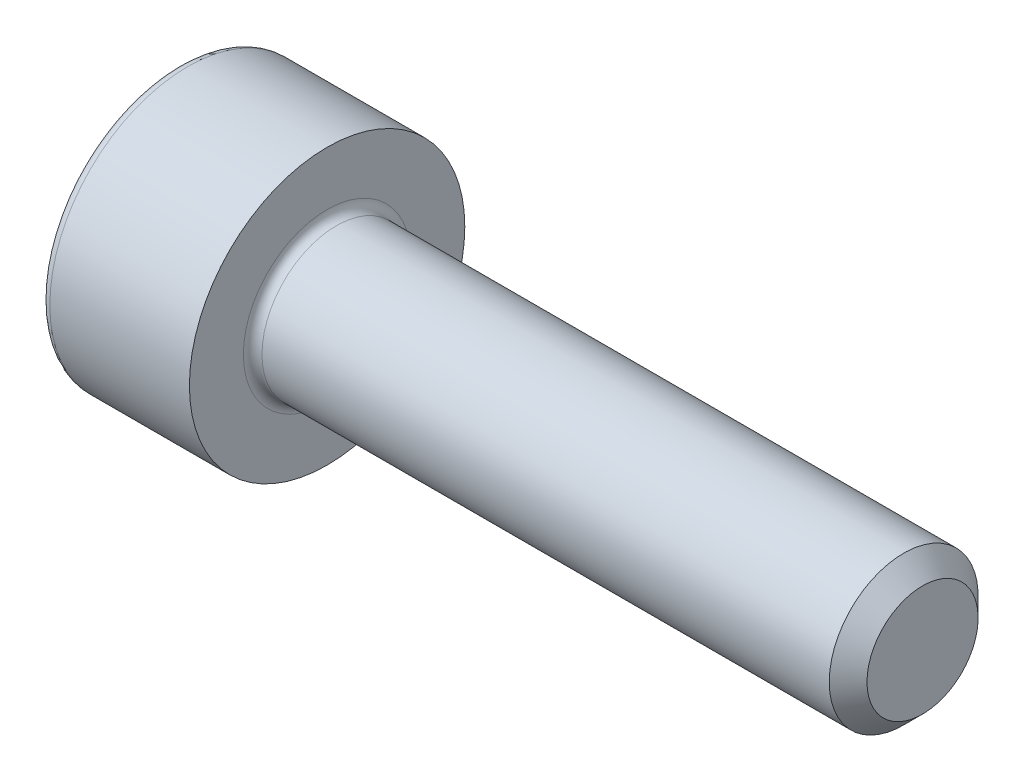
ISO-10303-21;
HEADER;
FILE_DESCRIPTION(('STEP AP214'),'2;1');
FILE_NAME('part.step','',(''),(''),'','','');
FILE_SCHEMA(('AUTOMOTIVE_DESIGN { 1 0 10303 214 1 1 1 1 }'));
ENDSEC;
DATA;
#1=APPLICATION_CONTEXT('core data for automotive mechanical design processes');
#2=APPLICATION_PROTOCOL_DEFINITION('international standard','automotive_design',2000,#1);
#3=PRODUCT_CONTEXT('',#1,'mechanical');
#4=PRODUCT('Part','Part','',(#3));
#5=PRODUCT_RELATED_PRODUCT_CATEGORY('part','',(#4));
#6=PRODUCT_DEFINITION_FORMATION('','',#4);
#7=PRODUCT_DEFINITION_CONTEXT('part definition',#1,'design');
#8=PRODUCT_DEFINITION('design','',#6,#7);
#9=PRODUCT_DEFINITION_SHAPE('','',#8);
#10=(LENGTH_UNIT() NAMED_UNIT(*) SI_UNIT(.MILLI.,.METRE.));
#11=(NAMED_UNIT(*) PLANE_ANGLE_UNIT() SI_UNIT($,.RADIAN.));
#12=(NAMED_UNIT(*) SI_UNIT($,.STERADIAN.) SOLID_ANGLE_UNIT());
#13=UNCERTAINTY_MEASURE_WITH_UNIT(LENGTH_MEASURE(1.E-05),#10,'distance_accuracy_value','');
#14=(GEOMETRIC_REPRESENTATION_CONTEXT(3) GLOBAL_UNCERTAINTY_ASSIGNED_CONTEXT((#13)) GLOBAL_UNIT_ASSIGNED_CONTEXT((#10,
#11,#12)) REPRESENTATION_CONTEXT('',''));
#15=CARTESIAN_POINT('',(0.,0.,0.));
#16=DIRECTION('',(0.,0.,1.));
#17=DIRECTION('',(1.,0.,0.));
#18=AXIS2_PLACEMENT_3D('',#15,#16,#17);
#19=CARTESIAN_POINT('',(8.,0.,0.));
#20=DIRECTION('',(-1.,0.,0.));
#21=DIRECTION('',(0.,0.,1.));
#22=AXIS2_PLACEMENT_3D('',#19,#20,#21);
#23=CONICAL_SURFACE('',#22,0.746499999993504,0.785398163397451);
#24=CARTESIAN_POINT('',(7.7464999999935,0.,0.));
#25=DIRECTION('',(-1.,0.,0.));
#26=DIRECTION('',(0.,0.,1.));
#27=AXIS2_PLACEMENT_3D('',#24,#25,#26);
#28=CIRCLE('',#27,1.);
#29=CARTESIAN_POINT('',(7.7464999999935,0.,1.));
#30=VERTEX_POINT('',#29);
#31=EDGE_CURVE('E11',#30,#30,#28,.T.);
#32=ORIENTED_EDGE('',*,*,#31,.F.);
#33=EDGE_LOOP('',(#32));
#34=FACE_BOUND('',#33,.T.);
#35=CARTESIAN_POINT('',(8.,0.,0.));
#36=DIRECTION('',(-1.,0.,0.));
#37=DIRECTION('',(0.,0.,1.));
#38=AXIS2_PLACEMENT_3D('',#35,#36,#37);
#39=CIRCLE('',#38,0.746499999993504);
#40=CARTESIAN_POINT('',(8.,0.,0.746499999993504));
#41=VERTEX_POINT('',#40);
#42=EDGE_CURVE('E136',#41,#41,#39,.T.);
#43=ORIENTED_EDGE('',*,*,#42,.T.);
#44=EDGE_LOOP('',(#43));
#45=FACE_BOUND('',#44,.T.);
#46=ADVANCED_FACE('F35',(#34,#45),#23,.T.);
#47=CARTESIAN_POINT('',(-2.,0.,0.));
#48=DIRECTION('',(-1.,0.,0.));
#49=DIRECTION('',(0.,0.,1.));
#50=AXIS2_PLACEMENT_3D('',#47,#48,#49);
#51=CYLINDRICAL_SURFACE('',#50,1.);
#52=CARTESIAN_POINT('',(0.125,0.,0.));
#53=DIRECTION('',(-1.,0.,0.));
#54=DIRECTION('',(0.,0.,1.));
#55=AXIS2_PLACEMENT_3D('',#52,#53,#54);
#56=CIRCLE('',#55,1.);
#57=CARTESIAN_POINT('',(0.125,0.,1.));
#58=VERTEX_POINT('',#57);
#59=EDGE_CURVE('E42',#58,#58,#56,.T.);
#60=ORIENTED_EDGE('',*,*,#59,.F.);
#61=EDGE_LOOP('',(#60));
#62=FACE_BOUND('',#61,.T.);
#63=ORIENTED_EDGE('',*,*,#31,.T.);
#64=EDGE_LOOP('',(#63));
#65=FACE_BOUND('',#64,.T.);
#66=ADVANCED_FACE('F160',(#62,#65),#51,.T.);
#67=CARTESIAN_POINT('',(0.125,0.,0.));
#68=DIRECTION('',(-1.,0.,0.));
#69=DIRECTION('',(0.,0.,1.));
#70=AXIS2_PLACEMENT_3D('',#67,#68,#69);
#71=TOROIDAL_SURFACE('',#70,1.125,0.125);
#72=CARTESIAN_POINT('',(0.,0.,0.));
#73=DIRECTION('',(-1.,0.,0.));
#74=DIRECTION('',(0.,0.,1.));
#75=AXIS2_PLACEMENT_3D('',#72,#73,#74);
#76=CIRCLE('',#75,1.125);
#77=CARTESIAN_POINT('',(0.,0.,1.125));
#78=VERTEX_POINT('',#77);
#79=EDGE_CURVE('E153',#78,#78,#76,.T.);
#80=ORIENTED_EDGE('',*,*,#79,.F.);
#81=EDGE_LOOP('',(#80));
#82=FACE_BOUND('',#81,.T.);
#83=ORIENTED_EDGE('',*,*,#59,.T.);
#84=EDGE_LOOP('',(#83));
#85=FACE_BOUND('',#84,.T.);
#86=ADVANCED_FACE('F158',(#82,#85),#71,.F.);
#87=CARTESIAN_POINT('',(0.,1.125,0.));
#88=DIRECTION('',(-1.,0.,0.));
#89=DIRECTION('',(0.,0.,1.));
#90=AXIS2_PLACEMENT_3D('',#87,#88,#89);
#91=PLANE('',#90);
#92=CARTESIAN_POINT('',(0.,0.,0.));
#93=DIRECTION('',(-1.,0.,0.));
#94=DIRECTION('',(0.,0.,1.));
#95=AXIS2_PLACEMENT_3D('',#92,#93,#94);
#96=CIRCLE('',#95,1.85);
#97=CARTESIAN_POINT('',(0.,0.,1.85));
#98=VERTEX_POINT('',#97);
#99=EDGE_CURVE('E150',#98,#98,#96,.T.);
#100=ORIENTED_EDGE('',*,*,#99,.F.);
#101=EDGE_LOOP('',(#100));
#102=FACE_BOUND('',#101,.T.);
#103=ORIENTED_EDGE('',*,*,#79,.T.);
#104=EDGE_LOOP('',(#103));
#105=FACE_BOUND('',#104,.T.);
#106=ADVANCED_FACE('F191',(#102,#105),#91,.F.);
#107=CARTESIAN_POINT('',(-2.,0.,0.));
#108=DIRECTION('',(-1.,0.,0.));
#109=DIRECTION('',(0.,0.,1.));
#110=AXIS2_PLACEMENT_3D('',#107,#108,#109);
#111=CYLINDRICAL_SURFACE('',#110,1.85);
#112=CARTESIAN_POINT('',(-1.875,0.,0.));
#113=DIRECTION('',(-1.,0.,0.));
#114=DIRECTION('',(0.,0.,1.));
#115=AXIS2_PLACEMENT_3D('',#112,#113,#114);
#116=CIRCLE('',#115,1.85);
#117=CARTESIAN_POINT('',(-1.875,0.,1.85));
#118=VERTEX_POINT('',#117);
#119=EDGE_CURVE('E147',#118,#118,#116,.T.);
#120=ORIENTED_EDGE('',*,*,#119,.F.);
#121=EDGE_LOOP('',(#120));
#122=FACE_BOUND('',#121,.T.);
#123=ORIENTED_EDGE('',*,*,#99,.T.);
#124=EDGE_LOOP('',(#123));
#125=FACE_BOUND('',#124,.T.);
#126=ADVANCED_FACE('F187',(#122,#125),#111,.T.);
#127=CARTESIAN_POINT('',(-1.875,0.,0.));
#128=DIRECTION('',(-1.,0.,0.));
#129=DIRECTION('',(0.,0.,1.));
#130=AXIS2_PLACEMENT_3D('',#127,#128,#129);
#131=TOROIDAL_SURFACE('',#130,1.725,0.125);
#132=CARTESIAN_POINT('',(-2.,0.,0.));
#133=DIRECTION('',(-1.,0.,0.));
#134=DIRECTION('',(0.,0.,1.));
#135=AXIS2_PLACEMENT_3D('',#132,#133,#134);
#136=CIRCLE('',#135,1.725);
#137=CARTESIAN_POINT('',(-2.,0.,1.725));
#138=VERTEX_POINT('',#137);
#139=EDGE_CURVE('E144',#138,#138,#136,.T.);
#140=ORIENTED_EDGE('',*,*,#139,.F.);
#141=EDGE_LOOP('',(#140));
#142=FACE_BOUND('',#141,.T.);
#143=ORIENTED_EDGE('',*,*,#119,.T.);
#144=EDGE_LOOP('',(#143));
#145=FACE_BOUND('',#144,.T.);
#146=ADVANCED_FACE('F180',(#142,#145),#131,.T.);
#147=CARTESIAN_POINT('',(-2.,1.725,0.));
#148=DIRECTION('',(1.,0.,0.));
#149=DIRECTION('',(0.,0.,-1.));
#150=AXIS2_PLACEMENT_3D('',#147,#148,#149);
#151=PLANE('',#150);
#152=DIRECTION('',(0.,0.5,-0.866025403784438));
#153=VECTOR('',#152,1.);
#154=CARTESIAN_POINT('',(-2.,0.433012701892219,0.75));
#155=LINE('',#154,#153);
#156=CARTESIAN_POINT('',(-2.,0.433012701892219,0.75));
#157=VERTEX_POINT('',#156);
#158=CARTESIAN_POINT('',(-2.,0.866025403784439,0.));
#159=VERTEX_POINT('',#158);
#160=EDGE_CURVE('E123',#157,#159,#155,.T.);
#161=ORIENTED_EDGE('',*,*,#160,.F.);
#162=DIRECTION('',(0.,1.,0.));
#163=VECTOR('',#162,1.);
#164=CARTESIAN_POINT('',(-2.,-0.43301270189222,0.75));
#165=LINE('',#164,#163);
#166=CARTESIAN_POINT('',(-2.,-0.43301270189222,0.75));
#167=VERTEX_POINT('',#166);
#168=EDGE_CURVE('E49',#167,#157,#165,.T.);
#169=ORIENTED_EDGE('',*,*,#168,.F.);
#170=DIRECTION('',(0.,0.5,0.866025403784439));
#171=VECTOR('',#170,1.);
#172=CARTESIAN_POINT('',(-2.,-0.866025403784439,0.));
#173=LINE('',#172,#171);
#174=CARTESIAN_POINT('',(-2.,-0.866025403784439,0.));
#175=VERTEX_POINT('',#174);
#176=EDGE_CURVE('E132',#175,#167,#173,.T.);
#177=ORIENTED_EDGE('',*,*,#176,.F.);
#178=DIRECTION('',(0.,-0.5,0.866025403784439));
#179=VECTOR('',#178,1.);
#180=CARTESIAN_POINT('',(-2.,-0.433012701892219,-0.75));
#181=LINE('',#180,#179);
#182=CARTESIAN_POINT('',(-2.,-0.433012701892219,-0.75));
#183=VERTEX_POINT('',#182);
#184=EDGE_CURVE('E130',#183,#175,#181,.T.);
#185=ORIENTED_EDGE('',*,*,#184,.F.);
#186=DIRECTION('',(0.,-1.,0.));
#187=VECTOR('',#186,1.);
#188=CARTESIAN_POINT('',(-2.,0.43301270189222,-0.75));
#189=LINE('',#188,#187);
#190=CARTESIAN_POINT('',(-2.,0.43301270189222,-0.75));
#191=VERTEX_POINT('',#190);
#192=EDGE_CURVE('E97',#191,#183,#189,.T.);
#193=ORIENTED_EDGE('',*,*,#192,.F.);
#194=DIRECTION('',(0.,-0.5,-0.866025403784439));
#195=VECTOR('',#194,1.);
#196=CARTESIAN_POINT('',(-2.,0.866025403784439,0.));
#197=LINE('',#196,#195);
#198=EDGE_CURVE('E126',#159,#191,#197,.T.);
#199=ORIENTED_EDGE('',*,*,#198,.F.);
#200=EDGE_LOOP('',(#161,#169,#177,#185,#193,#199));
#201=FACE_BOUND('',#200,.T.);
#202=ORIENTED_EDGE('',*,*,#139,.T.);
#203=EDGE_LOOP('',(#202));
#204=FACE_BOUND('',#203,.T.);
#205=ADVANCED_FACE('F172',(#201,#204),#151,.F.);
#206=CARTESIAN_POINT('',(8.,0.746499999993504,0.));
#207=DIRECTION('',(-1.,0.,0.));
#208=DIRECTION('',(0.,0.,1.));
#209=AXIS2_PLACEMENT_3D('',#206,#207,#208);
#210=PLANE('',#209);
#211=ORIENTED_EDGE('',*,*,#42,.F.);
#212=EDGE_LOOP('',(#211));
#213=FACE_BOUND('',#212,.T.);
#214=ADVANCED_FACE('F169',(#213),#210,.F.);
#215=CARTESIAN_POINT('',(-0.9,-0.43301270189222,0.75));
#216=DIRECTION('',(0.,0.,1.));
#217=DIRECTION('',(1.,0.,0.));
#218=AXIS2_PLACEMENT_3D('',#215,#216,#217);
#219=PLANE('',#218);
#220=ORIENTED_EDGE('',*,*,#168,.T.);
#221=DIRECTION('',(-1.,0.,0.));
#222=VECTOR('',#221,1.);
#223=CARTESIAN_POINT('',(-0.9,0.433012701892219,0.75));
#224=LINE('',#223,#222);
#225=CARTESIAN_POINT('',(-0.9,0.433012701892219,0.75));
#226=VERTEX_POINT('',#225);
#227=EDGE_CURVE('E79',#226,#157,#224,.T.);
#228=ORIENTED_EDGE('',*,*,#227,.F.);
#229=DIRECTION('',(0.,1.,0.));
#230=VECTOR('',#229,1.);
#231=CARTESIAN_POINT('',(-0.9,-0.43301270189222,0.75));
#232=LINE('',#231,#230);
#233=CARTESIAN_POINT('',(-0.9,-0.43301270189222,0.75));
#234=VERTEX_POINT('',#233);
#235=EDGE_CURVE('E134',#234,#226,#232,.T.);
#236=ORIENTED_EDGE('',*,*,#235,.F.);
#237=DIRECTION('',(-1.,0.,0.));
#238=VECTOR('',#237,1.);
#239=CARTESIAN_POINT('',(-0.9,-0.43301270189222,0.75));
#240=LINE('',#239,#238);
#241=EDGE_CURVE('E57',#234,#167,#240,.T.);
#242=ORIENTED_EDGE('',*,*,#241,.T.);
#243=EDGE_LOOP('',(#220,#228,#236,#242));
#244=FACE_BOUND('',#243,.T.);
#245=ADVANCED_FACE('F171',(#244),#219,.F.);
#246=CARTESIAN_POINT('',(-0.9,-0.866025403784439,0.));
#247=DIRECTION('',(0.,-0.866025403784439,0.5));
#248=DIRECTION('',(0.,-0.5,-0.866025403784439));
#249=AXIS2_PLACEMENT_3D('',#246,#247,#248);
#250=PLANE('',#249);
#251=ORIENTED_EDGE('',*,*,#176,.T.);
#252=ORIENTED_EDGE('',*,*,#241,.F.);
#253=DIRECTION('',(0.,0.5,0.866025403784439));
#254=VECTOR('',#253,1.);
#255=CARTESIAN_POINT('',(-0.9,-0.866025403784439,0.));
#256=LINE('',#255,#254);
#257=CARTESIAN_POINT('',(-0.9,-0.866025403784439,0.));
#258=VERTEX_POINT('',#257);
#259=EDGE_CURVE('E109',#258,#234,#256,.T.);
#260=ORIENTED_EDGE('',*,*,#259,.F.);
#261=DIRECTION('',(-1.,0.,0.));
#262=VECTOR('',#261,1.);
#263=CARTESIAN_POINT('',(-0.9,-0.866025403784439,0.));
#264=LINE('',#263,#262);
#265=EDGE_CURVE('E101',#258,#175,#264,.T.);
#266=ORIENTED_EDGE('',*,*,#265,.T.);
#267=EDGE_LOOP('',(#251,#252,#260,#266));
#268=FACE_BOUND('',#267,.T.);
#269=ADVANCED_FACE('F178',(#268),#250,.F.);
#270=CARTESIAN_POINT('',(-0.9,-0.433012701892219,-0.75));
#271=DIRECTION('',(0.,-0.866025403784439,-0.5));
#272=DIRECTION('',(0.,0.5,-0.866025403784439));
#273=AXIS2_PLACEMENT_3D('',#270,#271,#272);
#274=PLANE('',#273);
#275=ORIENTED_EDGE('',*,*,#184,.T.);
#276=ORIENTED_EDGE('',*,*,#265,.F.);
#277=DIRECTION('',(0.,-0.5,0.866025403784439));
#278=VECTOR('',#277,1.);
#279=CARTESIAN_POINT('',(-0.9,-0.433012701892219,-0.75));
#280=LINE('',#279,#278);
#281=CARTESIAN_POINT('',(-0.9,-0.433012701892219,-0.75));
#282=VERTEX_POINT('',#281);
#283=EDGE_CURVE('E105',#282,#258,#280,.T.);
#284=ORIENTED_EDGE('',*,*,#283,.F.);
#285=DIRECTION('',(-1.,0.,0.));
#286=VECTOR('',#285,1.);
#287=CARTESIAN_POINT('',(-0.9,-0.433012701892219,-0.75));
#288=LINE('',#287,#286);
#289=EDGE_CURVE('E90',#282,#183,#288,.T.);
#290=ORIENTED_EDGE('',*,*,#289,.T.);
#291=EDGE_LOOP('',(#275,#276,#284,#290));
#292=FACE_BOUND('',#291,.T.);
#293=ADVANCED_FACE('F106',(#292),#274,.F.);
#294=CARTESIAN_POINT('',(-0.9,0.43301270189222,-0.75));
#295=DIRECTION('',(0.,0.,-1.));
#296=DIRECTION('',(0.,1.,0.));
#297=AXIS2_PLACEMENT_3D('',#294,#295,#296);
#298=PLANE('',#297);
#299=ORIENTED_EDGE('',*,*,#192,.T.);
#300=ORIENTED_EDGE('',*,*,#289,.F.);
#301=DIRECTION('',(0.,-1.,0.));
#302=VECTOR('',#301,1.);
#303=CARTESIAN_POINT('',(-0.9,0.43301270189222,-0.75));
#304=LINE('',#303,#302);
#305=CARTESIAN_POINT('',(-0.9,0.43301270189222,-0.75));
#306=VERTEX_POINT('',#305);
#307=EDGE_CURVE('E94',#306,#282,#304,.T.);
#308=ORIENTED_EDGE('',*,*,#307,.F.);
#309=DIRECTION('',(-1.,0.,0.));
#310=VECTOR('',#309,1.);
#311=CARTESIAN_POINT('',(-0.9,0.43301270189222,-0.75));
#312=LINE('',#311,#310);
#313=EDGE_CURVE('E102',#306,#191,#312,.T.);
#314=ORIENTED_EDGE('',*,*,#313,.T.);
#315=EDGE_LOOP('',(#299,#300,#308,#314));
#316=FACE_BOUND('',#315,.T.);
#317=ADVANCED_FACE('F92',(#316),#298,.F.);
#318=CARTESIAN_POINT('',(-0.9,0.866025403784439,0.));
#319=DIRECTION('',(0.,0.866025403784439,-0.5));
#320=DIRECTION('',(0.,0.5,0.866025403784439));
#321=AXIS2_PLACEMENT_3D('',#318,#319,#320);
#322=PLANE('',#321);
#323=ORIENTED_EDGE('',*,*,#198,.T.);
#324=ORIENTED_EDGE('',*,*,#313,.F.);
#325=DIRECTION('',(0.,-0.5,-0.866025403784439));
#326=VECTOR('',#325,1.);
#327=CARTESIAN_POINT('',(-0.9,0.866025403784439,0.));
#328=LINE('',#327,#326);
#329=CARTESIAN_POINT('',(-0.9,0.866025403784439,0.));
#330=VERTEX_POINT('',#329);
#331=EDGE_CURVE('E115',#330,#306,#328,.T.);
#332=ORIENTED_EDGE('',*,*,#331,.F.);
#333=DIRECTION('',(-1.,0.,0.));
#334=VECTOR('',#333,1.);
#335=CARTESIAN_POINT('',(-0.9,0.866025403784439,0.));
#336=LINE('',#335,#334);
#337=EDGE_CURVE('E139',#330,#159,#336,.T.);
#338=ORIENTED_EDGE('',*,*,#337,.T.);
#339=EDGE_LOOP('',(#323,#324,#332,#338));
#340=FACE_BOUND('',#339,.T.);
#341=ADVANCED_FACE('F253',(#340),#322,.F.);
#342=CARTESIAN_POINT('',(-0.9,0.433012701892219,0.75));
#343=DIRECTION('',(0.,0.866025403784439,0.5));
#344=DIRECTION('',(0.,-0.5,0.866025403784438));
#345=AXIS2_PLACEMENT_3D('',#342,#343,#344);
#346=PLANE('',#345);
#347=ORIENTED_EDGE('',*,*,#160,.T.);
#348=ORIENTED_EDGE('',*,*,#337,.F.);
#349=DIRECTION('',(0.,0.5,-0.866025403784438));
#350=VECTOR('',#349,1.);
#351=CARTESIAN_POINT('',(-0.9,0.433012701892219,0.75));
#352=LINE('',#351,#350);
#353=EDGE_CURVE('E117',#226,#330,#352,.T.);
#354=ORIENTED_EDGE('',*,*,#353,.F.);
#355=ORIENTED_EDGE('',*,*,#227,.T.);
#356=EDGE_LOOP('',(#347,#348,#354,#355));
#357=FACE_BOUND('',#356,.T.);
#358=ADVANCED_FACE('F262',(#357),#346,.F.);
#359=CARTESIAN_POINT('',(-0.9,0.,0.));
#360=DIRECTION('',(-1.,0.,0.));
#361=DIRECTION('',(0.,0.,1.));
#362=AXIS2_PLACEMENT_3D('',#359,#360,#361);
#363=PLANE('',#362);
#364=ORIENTED_EDGE('',*,*,#235,.T.);
#365=ORIENTED_EDGE('',*,*,#353,.T.);
#366=ORIENTED_EDGE('',*,*,#331,.T.);
#367=ORIENTED_EDGE('',*,*,#307,.T.);
#368=ORIENTED_EDGE('',*,*,#283,.T.);
#369=ORIENTED_EDGE('',*,*,#259,.T.);
#370=EDGE_LOOP('',(#364,#365,#366,#367,#368,#369));
#371=FACE_BOUND('',#370,.T.);
#372=ADVANCED_FACE('F112',(#371),#363,.T.);
#373=CLOSED_SHELL('',(#46,#66,#86,#106,#126,#146,#205,#214,#245,#269,#293,#317,#341,#358,#372));
#374=MANIFOLD_SOLID_BREP('B2',#373);
#375=ADVANCED_BREP_SHAPE_REPRESENTATION('',(#18,#374),#14);
#376=SHAPE_DEFINITION_REPRESENTATION(#9,#375);
ENDSEC;
END-ISO-10303-21;
